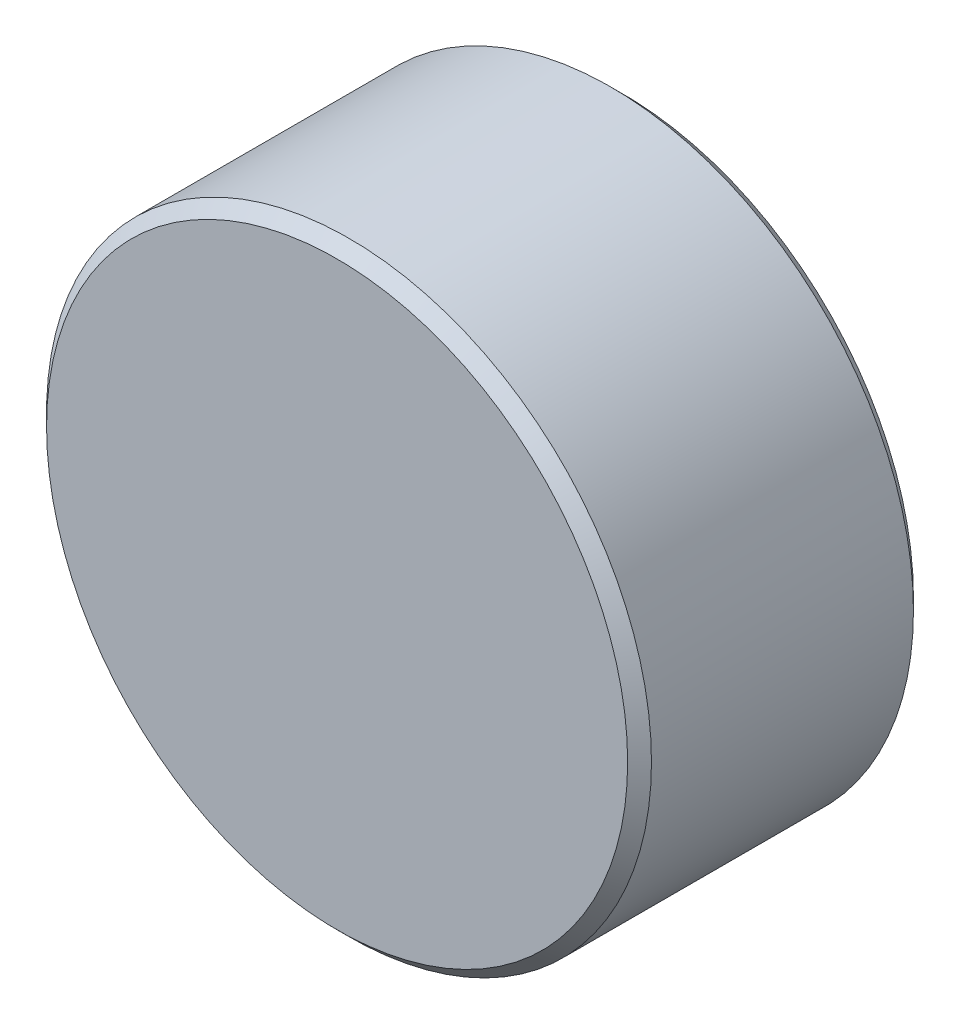
ISO-10303-21;
HEADER;
FILE_DESCRIPTION(('STEP AP214'),'2;1');
FILE_NAME('part.step','',(''),(''),'','','');
FILE_SCHEMA(('AUTOMOTIVE_DESIGN { 1 0 10303 214 1 1 1 1 }'));
ENDSEC;
DATA;
#1=APPLICATION_CONTEXT('core data for automotive mechanical design processes');
#2=APPLICATION_PROTOCOL_DEFINITION('international standard','automotive_design',2000,#1);
#3=PRODUCT_CONTEXT('',#1,'mechanical');
#4=PRODUCT('Part','Part','',(#3));
#5=PRODUCT_RELATED_PRODUCT_CATEGORY('part','',(#4));
#6=PRODUCT_DEFINITION_FORMATION('','',#4);
#7=PRODUCT_DEFINITION_CONTEXT('part definition',#1,'design');
#8=PRODUCT_DEFINITION('design','',#6,#7);
#9=PRODUCT_DEFINITION_SHAPE('','',#8);
#10=(LENGTH_UNIT() NAMED_UNIT(*) SI_UNIT(.MILLI.,.METRE.));
#11=(NAMED_UNIT(*) PLANE_ANGLE_UNIT() SI_UNIT($,.RADIAN.));
#12=(NAMED_UNIT(*) SI_UNIT($,.STERADIAN.) SOLID_ANGLE_UNIT());
#13=UNCERTAINTY_MEASURE_WITH_UNIT(LENGTH_MEASURE(1.E-05),#10,'distance_accuracy_value','');
#14=(GEOMETRIC_REPRESENTATION_CONTEXT(3) GLOBAL_UNCERTAINTY_ASSIGNED_CONTEXT((#13)) GLOBAL_UNIT_ASSIGNED_CONTEXT((#10,
#11,#12)) REPRESENTATION_CONTEXT('',''));
#15=CARTESIAN_POINT('',(0.,0.,0.));
#16=DIRECTION('',(0.,0.,1.));
#17=DIRECTION('',(1.,0.,0.));
#18=AXIS2_PLACEMENT_3D('',#15,#16,#17);
#19=CARTESIAN_POINT('',(0.,0.,3.));
#20=DIRECTION('',(0.,0.,-1.));
#21=DIRECTION('',(-1.,0.,0.));
#22=AXIS2_PLACEMENT_3D('',#19,#20,#21);
#23=CYLINDRICAL_SURFACE('',#22,6.35);
#24=CARTESIAN_POINT('',(0.,0.,-2.75));
#25=DIRECTION('',(0.,0.,1.));
#26=DIRECTION('',(1.,0.,0.));
#27=AXIS2_PLACEMENT_3D('',#24,#25,#26);
#28=CIRCLE('',#27,6.35);
#29=CARTESIAN_POINT('',(6.35,0.,-2.75));
#30=VERTEX_POINT('',#29);
#31=EDGE_CURVE('E43',#30,#30,#28,.T.);
#32=ORIENTED_EDGE('',*,*,#31,.T.);
#33=EDGE_LOOP('',(#32));
#34=FACE_BOUND('',#33,.T.);
#35=CARTESIAN_POINT('',(0.,0.,2.75));
#36=DIRECTION('',(0.,0.,1.));
#37=DIRECTION('',(1.,0.,0.));
#38=AXIS2_PLACEMENT_3D('',#35,#36,#37);
#39=CIRCLE('',#38,6.35);
#40=CARTESIAN_POINT('',(6.35,0.,2.75));
#41=VERTEX_POINT('',#40);
#42=EDGE_CURVE('E47',#41,#41,#39,.F.);
#43=ORIENTED_EDGE('',*,*,#42,.T.);
#44=EDGE_LOOP('',(#43));
#45=FACE_BOUND('',#44,.T.);
#46=ADVANCED_FACE('F32',(#34,#45),#23,.T.);
#47=CARTESIAN_POINT('',(0.,0.,3.));
#48=DIRECTION('',(0.,0.,1.));
#49=DIRECTION('',(1.,0.,0.));
#50=AXIS2_PLACEMENT_3D('',#47,#48,#49);
#51=PLANE('',#50);
#52=CARTESIAN_POINT('',(0.,0.,3.));
#53=DIRECTION('',(0.,0.,1.));
#54=DIRECTION('',(1.,0.,0.));
#55=AXIS2_PLACEMENT_3D('',#52,#53,#54);
#56=CIRCLE('',#55,6.1);
#57=CARTESIAN_POINT('',(6.1,0.,3.));
#58=VERTEX_POINT('',#57);
#59=EDGE_CURVE('E10',#58,#58,#56,.T.);
#60=ORIENTED_EDGE('',*,*,#59,.T.);
#61=EDGE_LOOP('',(#60));
#62=FACE_BOUND('',#61,.T.);
#63=ADVANCED_FACE('F63',(#62),#51,.T.);
#64=CARTESIAN_POINT('',(0.,0.,-3.));
#65=DIRECTION('',(0.,0.,1.));
#66=DIRECTION('',(1.,0.,0.));
#67=AXIS2_PLACEMENT_3D('',#64,#65,#66);
#68=PLANE('',#67);
#69=CARTESIAN_POINT('',(0.,0.,-3.));
#70=DIRECTION('',(0.,0.,1.));
#71=DIRECTION('',(1.,0.,0.));
#72=AXIS2_PLACEMENT_3D('',#69,#70,#71);
#73=CIRCLE('',#72,6.1);
#74=CARTESIAN_POINT('',(6.1,0.,-3.));
#75=VERTEX_POINT('',#74);
#76=EDGE_CURVE('E39',#75,#75,#73,.F.);
#77=ORIENTED_EDGE('',*,*,#76,.T.);
#78=EDGE_LOOP('',(#77));
#79=FACE_BOUND('',#78,.T.);
#80=ADVANCED_FACE('F60',(#79),#68,.F.);
#81=CARTESIAN_POINT('',(0.,0.,-2.75));
#82=DIRECTION('',(0.,0.,1.));
#83=DIRECTION('',(1.,0.,0.));
#84=AXIS2_PLACEMENT_3D('',#81,#82,#83);
#85=CONICAL_SURFACE('',#84,6.35,0.785398163397455);
#86=ORIENTED_EDGE('',*,*,#76,.F.);
#87=EDGE_LOOP('',(#86));
#88=FACE_BOUND('',#87,.T.);
#89=ORIENTED_EDGE('',*,*,#31,.F.);
#90=EDGE_LOOP('',(#89));
#91=FACE_BOUND('',#90,.T.);
#92=ADVANCED_FACE('F56',(#88,#91),#85,.T.);
#93=CARTESIAN_POINT('',(0.,0.,3.));
#94=DIRECTION('',(0.,0.,-1.));
#95=DIRECTION('',(-1.,0.,0.));
#96=AXIS2_PLACEMENT_3D('',#93,#94,#95);
#97=CONICAL_SURFACE('',#96,6.1,0.785398163397448);
#98=ORIENTED_EDGE('',*,*,#42,.F.);
#99=EDGE_LOOP('',(#98));
#100=FACE_BOUND('',#99,.T.);
#101=ORIENTED_EDGE('',*,*,#59,.F.);
#102=EDGE_LOOP('',(#101));
#103=FACE_BOUND('',#102,.T.);
#104=ADVANCED_FACE('F34',(#100,#103),#97,.T.);
#105=CLOSED_SHELL('',(#46,#63,#80,#92,#104));
#106=MANIFOLD_SOLID_BREP('B2',#105);
#107=ADVANCED_BREP_SHAPE_REPRESENTATION('',(#18,#106),#14);
#108=SHAPE_DEFINITION_REPRESENTATION(#9,#107);
ENDSEC;
END-ISO-10303-21;
